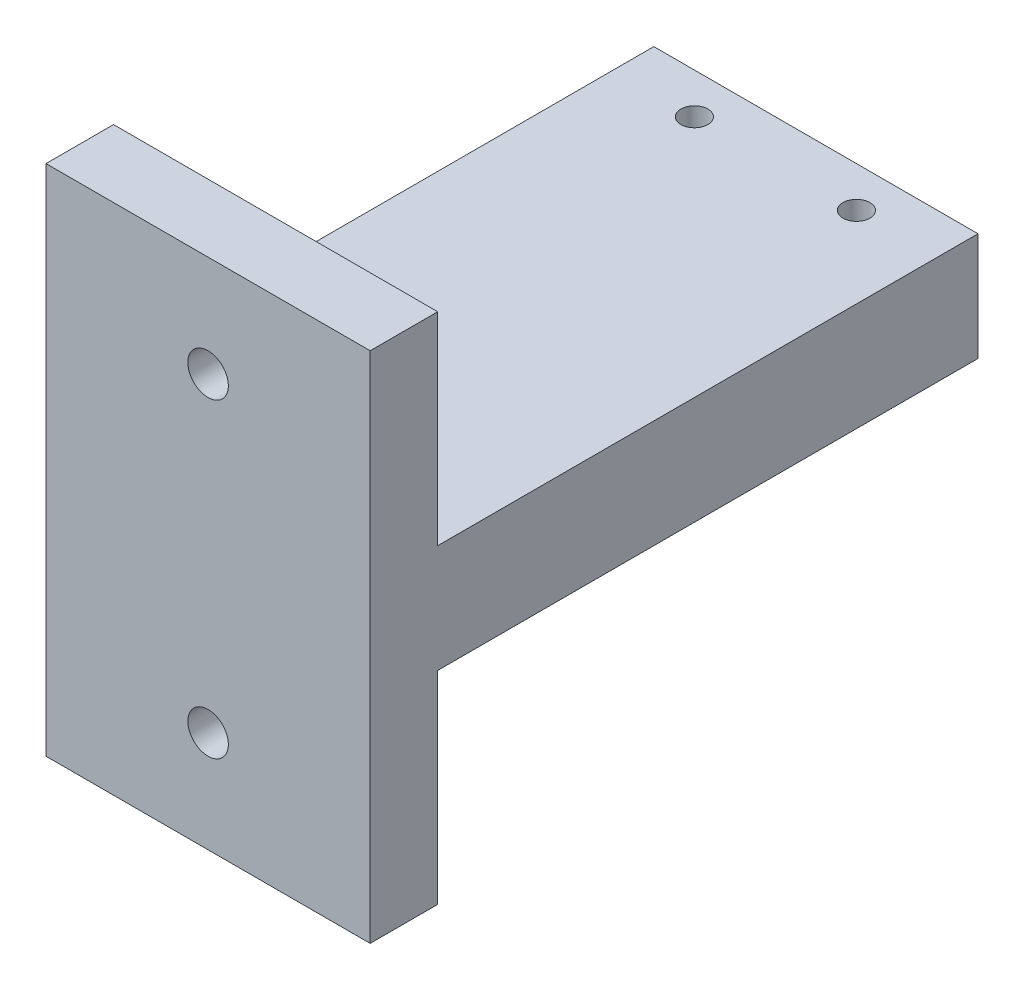
ISO-10303-21;
HEADER;
FILE_DESCRIPTION(('STEP AP214'),'2;1');
FILE_NAME('part.step','',(''),(''),'','','');
FILE_SCHEMA(('AUTOMOTIVE_DESIGN { 1 0 10303 214 1 1 1 1 }'));
ENDSEC;
DATA;
#1=APPLICATION_CONTEXT('core data for automotive mechanical design processes');
#2=APPLICATION_PROTOCOL_DEFINITION('international standard','automotive_design',2000,#1);
#3=PRODUCT_CONTEXT('',#1,'mechanical');
#4=PRODUCT('Part','Part','',(#3));
#5=PRODUCT_RELATED_PRODUCT_CATEGORY('part','',(#4));
#6=PRODUCT_DEFINITION_FORMATION('','',#4);
#7=PRODUCT_DEFINITION_CONTEXT('part definition',#1,'design');
#8=PRODUCT_DEFINITION('design','',#6,#7);
#9=PRODUCT_DEFINITION_SHAPE('','',#8);
#10=(LENGTH_UNIT() NAMED_UNIT(*) SI_UNIT(.MILLI.,.METRE.));
#11=(NAMED_UNIT(*) PLANE_ANGLE_UNIT() SI_UNIT($,.RADIAN.));
#12=(NAMED_UNIT(*) SI_UNIT($,.STERADIAN.) SOLID_ANGLE_UNIT());
#13=UNCERTAINTY_MEASURE_WITH_UNIT(LENGTH_MEASURE(1.E-05),#10,'distance_accuracy_value','');
#14=(GEOMETRIC_REPRESENTATION_CONTEXT(3) GLOBAL_UNCERTAINTY_ASSIGNED_CONTEXT((#13)) GLOBAL_UNIT_ASSIGNED_CONTEXT((#10,
#11,#12)) REPRESENTATION_CONTEXT('',''));
#15=CARTESIAN_POINT('',(0.,0.,0.));
#16=DIRECTION('',(0.,0.,1.));
#17=DIRECTION('',(1.,0.,0.));
#18=AXIS2_PLACEMENT_3D('',#15,#16,#17);
#19=CARTESIAN_POINT('',(0.,0.,0.));
#20=DIRECTION('',(0.,1.,0.));
#21=DIRECTION('',(0.,0.,1.));
#22=AXIS2_PLACEMENT_3D('',#19,#20,#21);
#23=PLANE('',#22);
#24=DIRECTION('',(1.,0.,0.));
#25=VECTOR('',#24,1.);
#26=CARTESIAN_POINT('',(4.80300617139721,0.,15.7496918588574));
#27=LINE('',#26,#25);
#28=CARTESIAN_POINT('',(-19.1969938286028,0.,15.7496918588574));
#29=VERTEX_POINT('',#28);
#30=CARTESIAN_POINT('',(4.80300617139721,0.,15.7496918588574));
#31=VERTEX_POINT('',#30);
#32=EDGE_CURVE('E55',#29,#31,#27,.T.);
#33=ORIENTED_EDGE('',*,*,#32,.F.);
#34=DIRECTION('',(0.,0.,1.));
#35=VECTOR('',#34,1.);
#36=CARTESIAN_POINT('',(-19.1969938286028,0.,-24.2503081411426));
#37=LINE('',#36,#35);
#38=CARTESIAN_POINT('',(-19.1969938286028,0.,-24.2503081411426));
#39=VERTEX_POINT('',#38);
#40=EDGE_CURVE('E171',#39,#29,#37,.T.);
#41=ORIENTED_EDGE('',*,*,#40,.F.);
#42=DIRECTION('',(-1.,0.,0.));
#43=VECTOR('',#42,1.);
#44=CARTESIAN_POINT('',(-19.1969938286028,0.,-24.2503081411426));
#45=LINE('',#44,#43);
#46=CARTESIAN_POINT('',(4.8030061713972,0.,-24.2503081411426));
#47=VERTEX_POINT('',#46);
#48=EDGE_CURVE('E176',#47,#39,#45,.T.);
#49=ORIENTED_EDGE('',*,*,#48,.F.);
#50=DIRECTION('',(0.,0.,-1.));
#51=VECTOR('',#50,1.);
#52=CARTESIAN_POINT('',(4.8030061713972,0.,-24.2503081411426));
#53=LINE('',#52,#51);
#54=EDGE_CURVE('E185',#31,#47,#53,.T.);
#55=ORIENTED_EDGE('',*,*,#54,.F.);
#56=EDGE_LOOP('',(#33,#41,#49,#55));
#57=FACE_BOUND('',#56,.T.);
#58=ADVANCED_FACE('F39',(#57),#23,.F.);
#59=CARTESIAN_POINT('',(-19.1969938286028,8.,-24.2503081411426));
#60=DIRECTION('',(1.,0.,0.));
#61=DIRECTION('',(0.,0.,-1.));
#62=AXIS2_PLACEMENT_3D('',#59,#60,#61);
#63=PLANE('',#62);
#64=ORIENTED_EDGE('',*,*,#40,.T.);
#65=DIRECTION('',(0.,1.,0.));
#66=VECTOR('',#65,1.);
#67=CARTESIAN_POINT('',(-19.1969938286028,-15.,15.7496918588574));
#68=LINE('',#67,#66);
#69=CARTESIAN_POINT('',(-19.1969938286028,-15.,15.7496918588574));
#70=VERTEX_POINT('',#69);
#71=EDGE_CURVE('E145',#70,#29,#68,.T.);
#72=ORIENTED_EDGE('',*,*,#71,.F.);
#73=DIRECTION('',(0.,0.,-1.));
#74=VECTOR('',#73,1.);
#75=CARTESIAN_POINT('',(-19.1969938286028,-15.,20.7496918588574));
#76=LINE('',#75,#74);
#77=CARTESIAN_POINT('',(-19.1969938286028,-15.,20.7496918588574));
#78=VERTEX_POINT('',#77);
#79=EDGE_CURVE('E123',#78,#70,#76,.T.);
#80=ORIENTED_EDGE('',*,*,#79,.F.);
#81=DIRECTION('',(0.,-1.,0.));
#82=VECTOR('',#81,1.);
#83=CARTESIAN_POINT('',(-19.1969938286028,8.,20.7496918588574));
#84=LINE('',#83,#82);
#85=CARTESIAN_POINT('',(-19.1969938286028,23.,20.7496918588574));
#86=VERTEX_POINT('',#85);
#87=EDGE_CURVE('E11',#86,#78,#84,.T.);
#88=ORIENTED_EDGE('',*,*,#87,.F.);
#89=DIRECTION('',(0.,0.,1.));
#90=VECTOR('',#89,1.);
#91=CARTESIAN_POINT('',(-19.1969938286028,23.,20.7496918588574));
#92=LINE('',#91,#90);
#93=CARTESIAN_POINT('',(-19.1969938286028,23.,15.7496918588574));
#94=VERTEX_POINT('',#93);
#95=EDGE_CURVE('E149',#94,#86,#92,.T.);
#96=ORIENTED_EDGE('',*,*,#95,.F.);
#97=DIRECTION('',(0.,-1.,0.));
#98=VECTOR('',#97,1.);
#99=CARTESIAN_POINT('',(-19.1969938286028,23.,15.7496918588574));
#100=LINE('',#99,#98);
#101=CARTESIAN_POINT('',(-19.1969938286028,8.,15.7496918588574));
#102=VERTEX_POINT('',#101);
#103=EDGE_CURVE('E161',#94,#102,#100,.T.);
#104=ORIENTED_EDGE('',*,*,#103,.T.);
#105=DIRECTION('',(0.,0.,1.));
#106=VECTOR('',#105,1.);
#107=CARTESIAN_POINT('',(-19.1969938286028,8.,-24.2503081411426));
#108=LINE('',#107,#106);
#109=CARTESIAN_POINT('',(-19.1969938286028,8.,-24.2503081411426));
#110=VERTEX_POINT('',#109);
#111=EDGE_CURVE('E172',#110,#102,#108,.T.);
#112=ORIENTED_EDGE('',*,*,#111,.F.);
#113=DIRECTION('',(0.,-1.,0.));
#114=VECTOR('',#113,1.);
#115=CARTESIAN_POINT('',(-19.1969938286028,8.,-24.2503081411426));
#116=LINE('',#115,#114);
#117=EDGE_CURVE('E182',#110,#39,#116,.T.);
#118=ORIENTED_EDGE('',*,*,#117,.T.);
#119=EDGE_LOOP('',(#64,#72,#80,#88,#96,#104,#112,#118));
#120=FACE_BOUND('',#119,.T.);
#121=ADVANCED_FACE('F41',(#120),#63,.F.);
#122=CARTESIAN_POINT('',(-19.1969938286028,8.,20.7496918588574));
#123=DIRECTION('',(0.,0.,-1.));
#124=DIRECTION('',(-1.,0.,0.));
#125=AXIS2_PLACEMENT_3D('',#122,#123,#124);
#126=PLANE('',#125);
#127=CARTESIAN_POINT('',(-7.19699382860279,15.5,20.7496918588574));
#128=DIRECTION('',(0.,0.,-1.));
#129=DIRECTION('',(-1.,0.,0.));
#130=AXIS2_PLACEMENT_3D('',#127,#128,#129);
#131=CIRCLE('',#130,1.5);
#132=CARTESIAN_POINT('',(-8.69699382860279,15.5,20.7496918588574));
#133=VERTEX_POINT('',#132);
#134=EDGE_CURVE('E132',#133,#133,#131,.T.);
#135=ORIENTED_EDGE('',*,*,#134,.T.);
#136=EDGE_LOOP('',(#135));
#137=FACE_BOUND('',#136,.T.);
#138=CARTESIAN_POINT('',(-7.19699382860279,-7.5,20.7496918588574));
#139=DIRECTION('',(0.,0.,-1.));
#140=DIRECTION('',(-1.,0.,0.));
#141=AXIS2_PLACEMENT_3D('',#138,#139,#140);
#142=CIRCLE('',#141,1.5);
#143=CARTESIAN_POINT('',(-8.69699382860279,-7.5,20.7496918588574));
#144=VERTEX_POINT('',#143);
#145=EDGE_CURVE('E241',#144,#144,#142,.T.);
#146=ORIENTED_EDGE('',*,*,#145,.T.);
#147=EDGE_LOOP('',(#146));
#148=FACE_BOUND('',#147,.T.);
#149=ORIENTED_EDGE('',*,*,#87,.T.);
#150=DIRECTION('',(-1.,0.,0.));
#151=VECTOR('',#150,1.);
#152=CARTESIAN_POINT('',(4.80300617139721,-15.,20.7496918588574));
#153=LINE('',#152,#151);
#154=CARTESIAN_POINT('',(4.80300617139721,-15.,20.7496918588574));
#155=VERTEX_POINT('',#154);
#156=EDGE_CURVE('E118',#155,#78,#153,.T.);
#157=ORIENTED_EDGE('',*,*,#156,.F.);
#158=DIRECTION('',(0.,-1.,0.));
#159=VECTOR('',#158,1.);
#160=CARTESIAN_POINT('',(4.80300617139721,8.,20.7496918588574));
#161=LINE('',#160,#159);
#162=CARTESIAN_POINT('',(4.80300617139721,23.,20.7496918588574));
#163=VERTEX_POINT('',#162);
#164=EDGE_CURVE('E48',#163,#155,#161,.T.);
#165=ORIENTED_EDGE('',*,*,#164,.F.);
#166=DIRECTION('',(1.,0.,0.));
#167=VECTOR('',#166,1.);
#168=CARTESIAN_POINT('',(-19.1969938286028,23.,20.7496918588574));
#169=LINE('',#168,#167);
#170=EDGE_CURVE('E153',#86,#163,#169,.T.);
#171=ORIENTED_EDGE('',*,*,#170,.F.);
#172=EDGE_LOOP('',(#149,#157,#165,#171));
#173=FACE_BOUND('',#172,.T.);
#174=ADVANCED_FACE('F119',(#137,#148,#173),#126,.F.);
#175=CARTESIAN_POINT('',(4.8030061713972,8.,-24.2503081411426));
#176=DIRECTION('',(-1.,0.,0.));
#177=DIRECTION('',(0.,0.,1.));
#178=AXIS2_PLACEMENT_3D('',#175,#176,#177);
#179=PLANE('',#178);
#180=ORIENTED_EDGE('',*,*,#164,.T.);
#181=DIRECTION('',(0.,0.,1.));
#182=VECTOR('',#181,1.);
#183=CARTESIAN_POINT('',(4.80300617139721,-15.,20.7496918588574));
#184=LINE('',#183,#182);
#185=CARTESIAN_POINT('',(4.80300617139721,-15.,15.7496918588574));
#186=VERTEX_POINT('',#185);
#187=EDGE_CURVE('E109',#186,#155,#184,.T.);
#188=ORIENTED_EDGE('',*,*,#187,.F.);
#189=DIRECTION('',(0.,1.,0.));
#190=VECTOR('',#189,1.);
#191=CARTESIAN_POINT('',(4.80300617139721,-15.,15.7496918588574));
#192=LINE('',#191,#190);
#193=EDGE_CURVE('E141',#186,#31,#192,.T.);
#194=ORIENTED_EDGE('',*,*,#193,.T.);
#195=ORIENTED_EDGE('',*,*,#54,.T.);
#196=DIRECTION('',(0.,-1.,0.));
#197=VECTOR('',#196,1.);
#198=CARTESIAN_POINT('',(4.8030061713972,8.,-24.2503081411426));
#199=LINE('',#198,#197);
#200=CARTESIAN_POINT('',(4.8030061713972,8.,-24.2503081411426));
#201=VERTEX_POINT('',#200);
#202=EDGE_CURVE('E116',#201,#47,#199,.T.);
#203=ORIENTED_EDGE('',*,*,#202,.F.);
#204=DIRECTION('',(0.,0.,-1.));
#205=VECTOR('',#204,1.);
#206=CARTESIAN_POINT('',(4.8030061713972,8.,-24.2503081411426));
#207=LINE('',#206,#205);
#208=CARTESIAN_POINT('',(4.80300617139721,8.,15.7496918588574));
#209=VERTEX_POINT('',#208);
#210=EDGE_CURVE('E175',#209,#201,#207,.T.);
#211=ORIENTED_EDGE('',*,*,#210,.F.);
#212=DIRECTION('',(0.,-1.,0.));
#213=VECTOR('',#212,1.);
#214=CARTESIAN_POINT('',(4.80300617139721,23.,15.7496918588574));
#215=LINE('',#214,#213);
#216=CARTESIAN_POINT('',(4.80300617139721,23.,15.7496918588574));
#217=VERTEX_POINT('',#216);
#218=EDGE_CURVE('E167',#217,#209,#215,.T.);
#219=ORIENTED_EDGE('',*,*,#218,.F.);
#220=DIRECTION('',(0.,0.,-1.));
#221=VECTOR('',#220,1.);
#222=CARTESIAN_POINT('',(4.80300617139721,23.,20.7496918588574));
#223=LINE('',#222,#221);
#224=EDGE_CURVE('E111',#163,#217,#223,.T.);
#225=ORIENTED_EDGE('',*,*,#224,.F.);
#226=EDGE_LOOP('',(#180,#188,#194,#195,#203,#211,#219,#225));
#227=FACE_BOUND('',#226,.T.);
#228=ADVANCED_FACE('F106',(#227),#179,.F.);
#229=CARTESIAN_POINT('',(-19.1969938286028,8.,-24.2503081411426));
#230=DIRECTION('',(0.,0.,1.));
#231=DIRECTION('',(1.,0.,0.));
#232=AXIS2_PLACEMENT_3D('',#229,#230,#231);
#233=PLANE('',#232);
#234=ORIENTED_EDGE('',*,*,#48,.T.);
#235=ORIENTED_EDGE('',*,*,#117,.F.);
#236=DIRECTION('',(-1.,0.,0.));
#237=VECTOR('',#236,1.);
#238=CARTESIAN_POINT('',(-19.1969938286028,8.,-24.2503081411426));
#239=LINE('',#238,#237);
#240=EDGE_CURVE('E179',#201,#110,#239,.T.);
#241=ORIENTED_EDGE('',*,*,#240,.F.);
#242=ORIENTED_EDGE('',*,*,#202,.T.);
#243=EDGE_LOOP('',(#234,#235,#241,#242));
#244=FACE_BOUND('',#243,.T.);
#245=ADVANCED_FACE('F199',(#244),#233,.F.);
#246=CARTESIAN_POINT('',(0.,8.,0.));
#247=DIRECTION('',(0.,1.,0.));
#248=DIRECTION('',(0.,0.,1.));
#249=AXIS2_PLACEMENT_3D('',#246,#247,#248);
#250=PLANE('',#249);
#251=CARTESIAN_POINT('',(-13.1969938286028,8.,-21.2503081411426));
#252=DIRECTION('',(0.,1.,0.));
#253=DIRECTION('',(0.,0.,1.));
#254=AXIS2_PLACEMENT_3D('',#251,#252,#253);
#255=CIRCLE('',#254,1.);
#256=CARTESIAN_POINT('',(-13.1969938286028,8.,-20.2503081411426));
#257=VERTEX_POINT('',#256);
#258=EDGE_CURVE('E262',#257,#257,#255,.T.);
#259=ORIENTED_EDGE('',*,*,#258,.F.);
#260=EDGE_LOOP('',(#259));
#261=FACE_BOUND('',#260,.T.);
#262=CARTESIAN_POINT('',(-1.1969938286028,8.,-21.2503081411426));
#263=DIRECTION('',(0.,1.,0.));
#264=DIRECTION('',(0.,0.,1.));
#265=AXIS2_PLACEMENT_3D('',#262,#263,#264);
#266=CIRCLE('',#265,1.);
#267=CARTESIAN_POINT('',(-1.1969938286028,8.,-20.2503081411426));
#268=VERTEX_POINT('',#267);
#269=EDGE_CURVE('E254',#268,#268,#266,.T.);
#270=ORIENTED_EDGE('',*,*,#269,.F.);
#271=EDGE_LOOP('',(#270));
#272=FACE_BOUND('',#271,.T.);
#273=DIRECTION('',(-1.,0.,0.));
#274=VECTOR('',#273,1.);
#275=CARTESIAN_POINT('',(-19.1969938286028,8.,15.7496918588574));
#276=LINE('',#275,#274);
#277=EDGE_CURVE('E63',#209,#102,#276,.T.);
#278=ORIENTED_EDGE('',*,*,#277,.F.);
#279=ORIENTED_EDGE('',*,*,#210,.T.);
#280=ORIENTED_EDGE('',*,*,#240,.T.);
#281=ORIENTED_EDGE('',*,*,#111,.T.);
#282=EDGE_LOOP('',(#278,#279,#280,#281));
#283=FACE_BOUND('',#282,.T.);
#284=ADVANCED_FACE('F227',(#261,#272,#283),#250,.T.);
#285=CARTESIAN_POINT('',(-19.1969938286028,23.,15.7496918588574));
#286=DIRECTION('',(0.,0.,1.));
#287=DIRECTION('',(1.,0.,0.));
#288=AXIS2_PLACEMENT_3D('',#285,#286,#287);
#289=PLANE('',#288);
#290=CARTESIAN_POINT('',(-7.19699382860279,15.5,15.7496918588574));
#291=DIRECTION('',(0.,0.,-1.));
#292=DIRECTION('',(-1.,0.,0.));
#293=AXIS2_PLACEMENT_3D('',#290,#291,#292);
#294=CIRCLE('',#293,1.5);
#295=CARTESIAN_POINT('',(-8.69699382860279,15.5,15.7496918588574));
#296=VERTEX_POINT('',#295);
#297=EDGE_CURVE('E244',#296,#296,#294,.T.);
#298=ORIENTED_EDGE('',*,*,#297,.F.);
#299=EDGE_LOOP('',(#298));
#300=FACE_BOUND('',#299,.T.);
#301=ORIENTED_EDGE('',*,*,#277,.T.);
#302=ORIENTED_EDGE('',*,*,#103,.F.);
#303=DIRECTION('',(-1.,0.,0.));
#304=VECTOR('',#303,1.);
#305=CARTESIAN_POINT('',(-19.1969938286028,23.,15.7496918588574));
#306=LINE('',#305,#304);
#307=EDGE_CURVE('E158',#217,#94,#306,.T.);
#308=ORIENTED_EDGE('',*,*,#307,.F.);
#309=ORIENTED_EDGE('',*,*,#218,.T.);
#310=EDGE_LOOP('',(#301,#302,#308,#309));
#311=FACE_BOUND('',#310,.T.);
#312=ADVANCED_FACE('F216',(#300,#311),#289,.F.);
#313=CARTESIAN_POINT('',(0.,23.,0.));
#314=DIRECTION('',(0.,-1.,0.));
#315=DIRECTION('',(0.,0.,-1.));
#316=AXIS2_PLACEMENT_3D('',#313,#314,#315);
#317=PLANE('',#316);
#318=ORIENTED_EDGE('',*,*,#95,.T.);
#319=ORIENTED_EDGE('',*,*,#170,.T.);
#320=ORIENTED_EDGE('',*,*,#224,.T.);
#321=ORIENTED_EDGE('',*,*,#307,.T.);
#322=EDGE_LOOP('',(#318,#319,#320,#321));
#323=FACE_BOUND('',#322,.T.);
#324=ADVANCED_FACE('F207',(#323),#317,.F.);
#325=CARTESIAN_POINT('',(4.80300617139721,-15.,15.7496918588574));
#326=DIRECTION('',(0.,0.,1.));
#327=DIRECTION('',(1.,0.,0.));
#328=AXIS2_PLACEMENT_3D('',#325,#326,#327);
#329=PLANE('',#328);
#330=CARTESIAN_POINT('',(-7.19699382860279,-7.5,15.7496918588574));
#331=DIRECTION('',(0.,0.,-1.));
#332=DIRECTION('',(-1.,0.,0.));
#333=AXIS2_PLACEMENT_3D('',#330,#331,#332);
#334=CIRCLE('',#333,1.5);
#335=CARTESIAN_POINT('',(-8.69699382860279,-7.5,15.7496918588574));
#336=VERTEX_POINT('',#335);
#337=EDGE_CURVE('E135',#336,#336,#334,.T.);
#338=ORIENTED_EDGE('',*,*,#337,.F.);
#339=EDGE_LOOP('',(#338));
#340=FACE_BOUND('',#339,.T.);
#341=ORIENTED_EDGE('',*,*,#32,.T.);
#342=ORIENTED_EDGE('',*,*,#193,.F.);
#343=DIRECTION('',(1.,0.,0.));
#344=VECTOR('',#343,1.);
#345=CARTESIAN_POINT('',(4.80300617139721,-15.,15.7496918588574));
#346=LINE('',#345,#344);
#347=EDGE_CURVE('E127',#70,#186,#346,.T.);
#348=ORIENTED_EDGE('',*,*,#347,.F.);
#349=ORIENTED_EDGE('',*,*,#71,.T.);
#350=EDGE_LOOP('',(#341,#342,#348,#349));
#351=FACE_BOUND('',#350,.T.);
#352=ADVANCED_FACE('F205',(#340,#351),#329,.F.);
#353=CARTESIAN_POINT('',(0.,-15.,0.));
#354=DIRECTION('',(0.,1.,0.));
#355=DIRECTION('',(0.,0.,1.));
#356=AXIS2_PLACEMENT_3D('',#353,#354,#355);
#357=PLANE('',#356);
#358=ORIENTED_EDGE('',*,*,#187,.T.);
#359=ORIENTED_EDGE('',*,*,#156,.T.);
#360=ORIENTED_EDGE('',*,*,#79,.T.);
#361=ORIENTED_EDGE('',*,*,#347,.T.);
#362=EDGE_LOOP('',(#358,#359,#360,#361));
#363=FACE_BOUND('',#362,.T.);
#364=ADVANCED_FACE('F125',(#363),#357,.F.);
#365=CARTESIAN_POINT('',(-7.19699382860279,-7.5,20.7496918588574));
#366=DIRECTION('',(0.,0.,-1.));
#367=DIRECTION('',(-1.,0.,0.));
#368=AXIS2_PLACEMENT_3D('',#365,#366,#367);
#369=CYLINDRICAL_SURFACE('',#368,1.5);
#370=ORIENTED_EDGE('',*,*,#145,.F.);
#371=EDGE_LOOP('',(#370));
#372=FACE_BOUND('',#371,.T.);
#373=ORIENTED_EDGE('',*,*,#337,.T.);
#374=EDGE_LOOP('',(#373));
#375=FACE_BOUND('',#374,.T.);
#376=ADVANCED_FACE('F214',(#372,#375),#369,.F.);
#377=CARTESIAN_POINT('',(-7.19699382860279,15.5,20.7496918588574));
#378=DIRECTION('',(0.,0.,-1.));
#379=DIRECTION('',(-1.,0.,0.));
#380=AXIS2_PLACEMENT_3D('',#377,#378,#379);
#381=CYLINDRICAL_SURFACE('',#380,1.5);
#382=ORIENTED_EDGE('',*,*,#134,.F.);
#383=EDGE_LOOP('',(#382));
#384=FACE_BOUND('',#383,.T.);
#385=ORIENTED_EDGE('',*,*,#297,.T.);
#386=EDGE_LOOP('',(#385));
#387=FACE_BOUND('',#386,.T.);
#388=ADVANCED_FACE('F285',(#384,#387),#381,.F.);
#389=CARTESIAN_POINT('',(-1.1969938286028,4.,-21.2503081411426));
#390=DIRECTION('',(0.,1.,0.));
#391=DIRECTION('',(0.,0.,1.));
#392=AXIS2_PLACEMENT_3D('',#389,#390,#391);
#393=CYLINDRICAL_SURFACE('',#392,1.);
#394=CARTESIAN_POINT('',(-1.1969938286028,4.,-21.2503081411426));
#395=DIRECTION('',(0.,1.,0.));
#396=DIRECTION('',(0.,0.,1.));
#397=AXIS2_PLACEMENT_3D('',#394,#395,#396);
#398=CIRCLE('',#397,1.);
#399=CARTESIAN_POINT('',(-1.1969938286028,4.,-20.2503081411426));
#400=VERTEX_POINT('',#399);
#401=EDGE_CURVE('E258',#400,#400,#398,.T.);
#402=ORIENTED_EDGE('',*,*,#401,.F.);
#403=EDGE_LOOP('',(#402));
#404=FACE_BOUND('',#403,.T.);
#405=ORIENTED_EDGE('',*,*,#269,.T.);
#406=EDGE_LOOP('',(#405));
#407=FACE_BOUND('',#406,.T.);
#408=ADVANCED_FACE('F283',(#404,#407),#393,.F.);
#409=CARTESIAN_POINT('',(-1.1969938286028,4.,-21.2503081411426));
#410=DIRECTION('',(0.,1.,0.));
#411=DIRECTION('',(0.,0.,1.));
#412=AXIS2_PLACEMENT_3D('',#409,#410,#411);
#413=PLANE('',#412);
#414=ORIENTED_EDGE('',*,*,#401,.T.);
#415=EDGE_LOOP('',(#414));
#416=FACE_BOUND('',#415,.T.);
#417=ADVANCED_FACE('F275',(#416),#413,.T.);
#418=CARTESIAN_POINT('',(-13.1969938286028,4.,-21.2503081411426));
#419=DIRECTION('',(0.,1.,0.));
#420=DIRECTION('',(0.,0.,1.));
#421=AXIS2_PLACEMENT_3D('',#418,#419,#420);
#422=CYLINDRICAL_SURFACE('',#421,1.);
#423=CARTESIAN_POINT('',(-13.1969938286028,4.,-21.2503081411426));
#424=DIRECTION('',(0.,1.,0.));
#425=DIRECTION('',(0.,0.,1.));
#426=AXIS2_PLACEMENT_3D('',#423,#424,#425);
#427=CIRCLE('',#426,1.);
#428=CARTESIAN_POINT('',(-13.1969938286028,4.,-20.2503081411426));
#429=VERTEX_POINT('',#428);
#430=EDGE_CURVE('E250',#429,#429,#427,.T.);
#431=ORIENTED_EDGE('',*,*,#430,.F.);
#432=EDGE_LOOP('',(#431));
#433=FACE_BOUND('',#432,.T.);
#434=ORIENTED_EDGE('',*,*,#258,.T.);
#435=EDGE_LOOP('',(#434));
#436=FACE_BOUND('',#435,.T.);
#437=ADVANCED_FACE('F272',(#433,#436),#422,.F.);
#438=CARTESIAN_POINT('',(-13.1969938286028,4.,-21.2503081411426));
#439=DIRECTION('',(0.,1.,0.));
#440=DIRECTION('',(0.,0.,1.));
#441=AXIS2_PLACEMENT_3D('',#438,#439,#440);
#442=PLANE('',#441);
#443=ORIENTED_EDGE('',*,*,#430,.T.);
#444=EDGE_LOOP('',(#443));
#445=FACE_BOUND('',#444,.T.);
#446=ADVANCED_FACE('F270',(#445),#442,.T.);
#447=CLOSED_SHELL('',(#58,#121,#174,#228,#245,#284,#312,#324,#352,#364,#376,#388,#408,#417,#437,#446));
#448=MANIFOLD_SOLID_BREP('B2',#447);
#449=ADVANCED_BREP_SHAPE_REPRESENTATION('',(#18,#448),#14);
#450=SHAPE_DEFINITION_REPRESENTATION(#9,#449);
ENDSEC;
END-ISO-10303-21;
